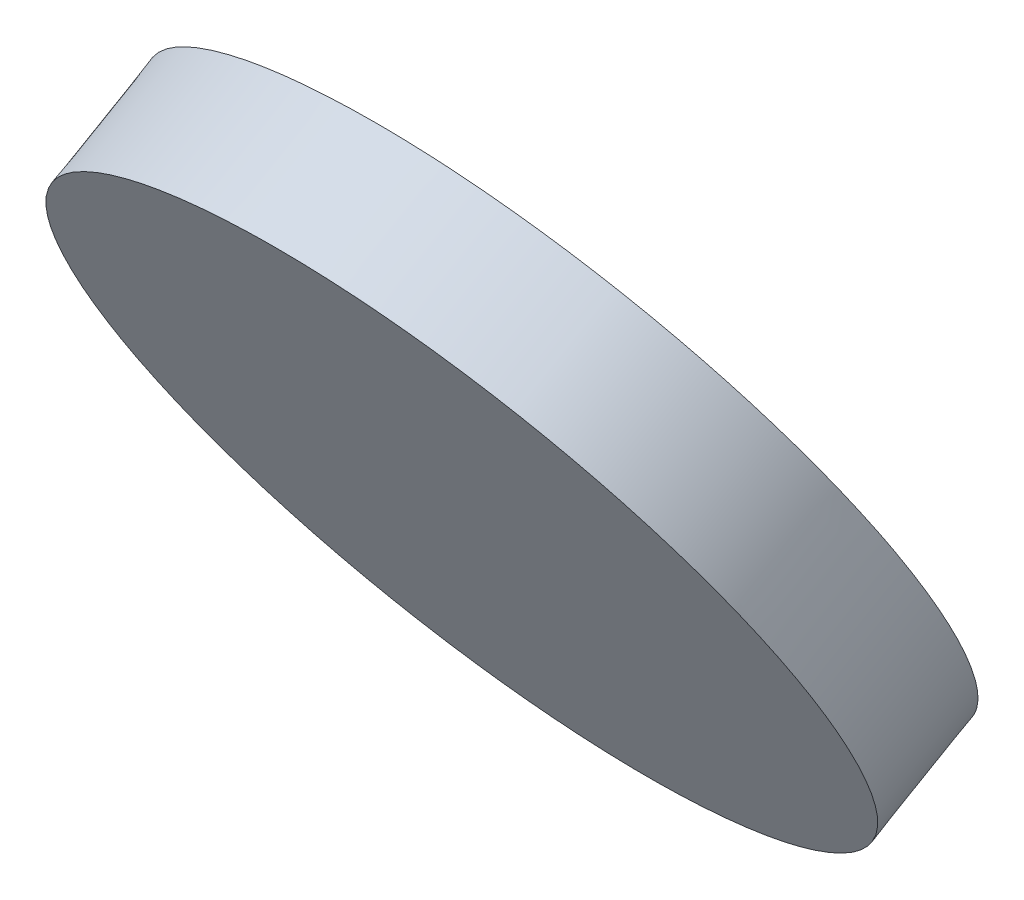
ISO-10303-21;
HEADER;
FILE_DESCRIPTION(('STEP AP214'),'2;1');
FILE_NAME('part.step','',(''),(''),'','','');
FILE_SCHEMA(('AUTOMOTIVE_DESIGN { 1 0 10303 214 1 1 1 1 }'));
ENDSEC;
DATA;
#1=APPLICATION_CONTEXT('core data for automotive mechanical design processes');
#2=APPLICATION_PROTOCOL_DEFINITION('international standard','automotive_design',2000,#1);
#3=PRODUCT_CONTEXT('',#1,'mechanical');
#4=PRODUCT('Part','Part','',(#3));
#5=PRODUCT_RELATED_PRODUCT_CATEGORY('part','',(#4));
#6=PRODUCT_DEFINITION_FORMATION('','',#4);
#7=PRODUCT_DEFINITION_CONTEXT('part definition',#1,'design');
#8=PRODUCT_DEFINITION('design','',#6,#7);
#9=PRODUCT_DEFINITION_SHAPE('','',#8);
#10=(LENGTH_UNIT() NAMED_UNIT(*) SI_UNIT(.MILLI.,.METRE.));
#11=(NAMED_UNIT(*) PLANE_ANGLE_UNIT() SI_UNIT($,.RADIAN.));
#12=(NAMED_UNIT(*) SI_UNIT($,.STERADIAN.) SOLID_ANGLE_UNIT());
#13=UNCERTAINTY_MEASURE_WITH_UNIT(LENGTH_MEASURE(1.E-05),#10,'distance_accuracy_value','');
#14=(GEOMETRIC_REPRESENTATION_CONTEXT(3) GLOBAL_UNCERTAINTY_ASSIGNED_CONTEXT((#13)) GLOBAL_UNIT_ASSIGNED_CONTEXT((#10,
#11,#12)) REPRESENTATION_CONTEXT('',''));
#15=CARTESIAN_POINT('',(0.,0.,0.));
#16=DIRECTION('',(0.,0.,1.));
#17=DIRECTION('',(1.,0.,0.));
#18=AXIS2_PLACEMENT_3D('',#15,#16,#17);
#19=CARTESIAN_POINT('',(12.5,13.3879679238206,-41.0328048076007));
#20=CARTESIAN_POINT('',(12.6682299792076,13.3879679238206,-41.0328048076007));
#21=CARTESIAN_POINT('',(13.0046899376229,13.3300082670677,-41.0662678310291));
#22=CARTESIAN_POINT('',(13.4325454072684,13.0824255601822,-41.2092097734961));
#23=CARTESIAN_POINT('',(13.7184292922025,12.7118918543211,-41.4231375083189));
#24=CARTESIAN_POINT('',(13.8188183624877,12.2748175473052,-41.6754824771304));
#25=CARTESIAN_POINT('',(13.7184292922025,11.8377432402894,-41.9278274459418));
#26=CARTESIAN_POINT('',(13.4325454072684,11.4672095344283,-42.1417551807646));
#27=CARTESIAN_POINT('',(13.0046899376229,11.2196268275428,-42.2846971232316));
#28=CARTESIAN_POINT('',(12.5,11.1326873424135,-42.3348916583742));
#29=CARTESIAN_POINT('',(11.9953100623771,11.2196268275428,-42.2846971232316));
#30=CARTESIAN_POINT('',(11.5674545927316,11.4672095344283,-42.1417551807645));
#31=CARTESIAN_POINT('',(11.2815707077975,11.8377432402894,-41.9278274459418));
#32=CARTESIAN_POINT('',(11.1811816375123,12.2748175473052,-41.6754824771304));
#33=CARTESIAN_POINT('',(11.2815707077975,12.7118918543211,-41.4231375083189));
#34=CARTESIAN_POINT('',(11.5674545927316,13.0824255601822,-41.2092097734961));
#35=CARTESIAN_POINT('',(11.9953100623771,13.3300082670677,-41.0662678310291));
#36=CARTESIAN_POINT('',(12.3317700207924,13.3879679238206,-41.0328048076007));
#37=CARTESIAN_POINT('',(12.5,13.3879679238206,-41.0328048076007));
#38=B_SPLINE_CURVE_WITH_KNOTS('',3,(#19,#20,#21,#22,#23,#24,#25,#26,#27,#28,#29,#30,#31,#32,#33,
#34,#35,#36,#37),.UNSPECIFIED.,.T.,.F.,(4,1,1,1,1,1,1,1,1,1,1,1,1,1,1,1,4),(0.,0.0625,
0.125000000000001,0.1875,0.25,0.3125,0.375,0.4375,0.5,0.5625,0.625,0.6875,0.75,0.8125,
0.874999999999999,0.9375,1.),.UNSPECIFIED.);
#39=DIRECTION('',(0.,0.499999999999995,-0.866025403784442));
#40=VECTOR('',#39,1.);
#41=SURFACE_OF_LINEAR_EXTRUSION('',#38,#40);
#42=CARTESIAN_POINT('',(12.5,13.3879679238206,-41.0328048076007));
#43=CARTESIAN_POINT('',(12.6682299792076,13.3879679238206,-41.0328048076007));
#44=CARTESIAN_POINT('',(13.0046899376229,13.3300082670677,-41.0662678310291));
#45=CARTESIAN_POINT('',(13.4325454072684,13.0824255601822,-41.2092097734961));
#46=CARTESIAN_POINT('',(13.7184292922025,12.7118918543211,-41.4231375083189));
#47=CARTESIAN_POINT('',(13.8188183624877,12.2748175473052,-41.6754824771303));
#48=CARTESIAN_POINT('',(13.7184292922025,11.8377432402894,-41.9278274459418));
#49=CARTESIAN_POINT('',(13.4325454072684,11.4672095344283,-42.1417551807646));
#50=CARTESIAN_POINT('',(13.0046899376229,11.2196268275428,-42.2846971232316));
#51=CARTESIAN_POINT('',(12.5,11.1326873424135,-42.3348916583742));
#52=CARTESIAN_POINT('',(11.9953100623771,11.2196268275428,-42.2846971232316));
#53=CARTESIAN_POINT('',(11.5674545927316,11.4672095344283,-42.1417551807645));
#54=CARTESIAN_POINT('',(11.2815707077975,11.8377432402894,-41.9278274459418));
#55=CARTESIAN_POINT('',(11.1811816375123,12.2748175473052,-41.6754824771304));
#56=CARTESIAN_POINT('',(11.2815707077975,12.7118918543211,-41.4231375083189));
#57=CARTESIAN_POINT('',(11.5674545927316,13.0824255601822,-41.2092097734961));
#58=CARTESIAN_POINT('',(11.9953100623771,13.3300082670677,-41.0662678310291));
#59=CARTESIAN_POINT('',(12.3317700207924,13.3879679238206,-41.0328048076007));
#60=CARTESIAN_POINT('',(12.5,13.3879679238206,-41.0328048076007));
#61=B_SPLINE_CURVE_WITH_KNOTS('',3,(#42,#43,#44,#45,#46,#47,#48,#49,#50,#51,#52,#53,#54,#55,#56,
#57,#58,#59,#60),.UNSPECIFIED.,.T.,.F.,(4,1,1,1,1,1,1,1,1,1,1,1,1,1,1,1,4),(0.,0.0625,
0.125000000000001,0.1875,0.25,0.3125,0.375,0.4375,0.5,0.5625,0.625,0.6875,0.75,0.8125,
0.874999999999999,0.9375,1.),.UNSPECIFIED.);
#62=CARTESIAN_POINT('',(12.5,13.3879679238206,-41.0328048076007));
#63=VERTEX_POINT('',#62);
#64=EDGE_CURVE('E10',#63,#63,#61,.T.);
#65=ORIENTED_EDGE('',*,*,#64,.T.);
#66=EDGE_LOOP('',(#65));
#67=FACE_BOUND('',#66,.T.);
#68=CARTESIAN_POINT('',(12.5,13.5879679238206,-41.3792149691145));
#69=CARTESIAN_POINT('',(12.4789707564107,13.5879679370051,-41.3792149615024));
#70=CARTESIAN_POINT('',(12.4579419493091,13.5875150942108,-41.3794764104116));
#71=CARTESIAN_POINT('',(12.4159343530486,13.5857124585183,-41.3805171626139));
#72=CARTESIAN_POINT('',(12.394955566905,13.5843626128517,-41.3812964963729));
#73=CARTESIAN_POINT('',(12.3530982075204,13.5807746122206,-41.3833680295031));
#74=CARTESIAN_POINT('',(12.3322196412557,13.578536396298,-41.3846602640685));
#75=CARTESIAN_POINT('',(12.2906126141021,13.5731802652805,-41.3877526277533));
#76=CARTESIAN_POINT('',(12.2698841597266,13.5700623122453,-41.3895527787775));
#77=CARTESIAN_POINT('',(12.2286273388163,13.5629552823521,-41.3936560243994));
#78=CARTESIAN_POINT('',(12.2080989722815,13.5589662054942,-41.3959591189972));
#79=CARTESIAN_POINT('',(12.167292290748,13.5501254880213,-41.40106330961));
#80=CARTESIAN_POINT('',(12.1470139650022,13.5452738846176,-41.4038643841411));
#81=CARTESIAN_POINT('',(12.1067573569788,13.5347166816437,-41.40995958812));
#82=CARTESIAN_POINT('',(12.0867790542061,13.529011140702,-41.4132536837186));
#83=CARTESIAN_POINT('',(12.0471724169556,13.5167546200185,-41.4203299892345));
#84=CARTESIAN_POINT('',(12.0275440619585,13.5102036900331,-41.424112170425));
#85=CARTESIAN_POINT('',(11.9886875521215,13.4962651035168,-41.4321596171023));
#86=CARTESIAN_POINT('',(11.9694593972816,13.4888774469859,-41.4364248825891));
#87=CARTESIAN_POINT('',(11.93144586824,13.4732901029195,-41.4454242398818));
#88=CARTESIAN_POINT('',(11.9126605201549,13.4650903676354,-41.4501583592553));
#89=CARTESIAN_POINT('',(11.8755748796246,13.4479034004617,-41.4600812593796));
#90=CARTESIAN_POINT('',(11.8572746205572,13.4389161145649,-41.4652700713115));
#91=CARTESIAN_POINT('',(11.8212015232752,13.4201785584249,-41.4760882043928));
#92=CARTESIAN_POINT('',(11.8034287078442,13.4104282552884,-41.4817175445333));
#93=CARTESIAN_POINT('',(11.7684528661265,13.3901891460976,-41.4934025996728));
#94=CARTESIAN_POINT('',(11.7512498398399,13.3797003400433,-41.4994583146718));
#95=CARTESIAN_POINT('',(11.7174559596882,13.3580086937487,-41.5119819924991));
#96=CARTESIAN_POINT('',(11.7008650794512,13.3468058843254,-41.5184499375353));
#97=CARTESIAN_POINT('',(11.668337890586,13.3237107142865,-41.5317839401743));
#98=CARTESIAN_POINT('',(11.6524015371157,13.3118184010442,-41.538649970426));
#99=CARTESIAN_POINT('',(11.6212257453276,13.287368675224,-41.5527660262099));
#100=CARTESIAN_POINT('',(11.6059862660659,13.2748113018148,-41.560016029128));
#101=CARTESIAN_POINT('',(11.5762467809678,13.2490561522244,-41.574885771677));
#102=CARTESIAN_POINT('',(11.5617467751315,13.2358583760433,-41.5825055113079));
#103=CARTESIAN_POINT('',(11.5335146635638,13.2088593483717,-41.598093407202));
#104=CARTESIAN_POINT('',(11.5197826030603,13.1950580614227,-41.6060615839371));
#105=CARTESIAN_POINT('',(11.4931145977823,13.1668886895517,-41.6223251783697));
#106=CARTESIAN_POINT('',(11.4801787077099,13.1525205657954,-41.6306206184882));
#107=CARTESIAN_POINT('',(11.4551313520553,13.1232542070916,-41.6475175585641));
#108=CARTESIAN_POINT('',(11.4430199220574,13.1083559493053,-41.6561190717074));
#109=CARTESIAN_POINT('',(11.4196498117784,13.0780659818592,-41.6736069925662));
#110=CARTESIAN_POINT('',(11.4083911314974,13.0626742721992,-41.6824934002817));
#111=CARTESIAN_POINT('',(11.3867548653347,13.0314340535596,-41.7005299489228));
#112=CARTESIAN_POINT('',(11.376377241471,13.015585564311,-41.7096800784567));
#113=CARTESIAN_POINT('',(11.3565314412224,12.983468457497,-41.7282228987214));
#114=CARTESIAN_POINT('',(11.3470632024752,12.9671998688375,-41.7376155727632));
#115=CARTESIAN_POINT('',(11.32906448789,12.9342791869969,-41.7566223372858));
#116=CARTESIAN_POINT('',(11.3205339569167,12.9176271164334,-41.7662364147082));
#117=CARTESIAN_POINT('',(11.3044390635613,12.8839763918238,-41.78566466962));
#118=CARTESIAN_POINT('',(11.2968747011792,12.8669777377776,-41.7954788471094));
#119=CARTESIAN_POINT('',(11.2827220901504,12.8326773837169,-41.8152821657597));
#120=CARTESIAN_POINT('',(11.2761338989574,12.8153756659322,-41.8252713171802));
#121=CARTESIAN_POINT('',(11.2639434909883,12.7805124208753,-41.8453996210986));
#122=CARTESIAN_POINT('',(11.2583413419106,12.7629508758539,-41.855538783844));
#123=CARTESIAN_POINT('',(11.2481329607271,12.7276112523987,-41.875942124959));
#124=CARTESIAN_POINT('',(11.2435267715891,12.7098331646577,-41.8862063087019));
#125=CARTESIAN_POINT('',(11.2353202801882,12.6741037119205,-41.9068347178577));
#126=CARTESIAN_POINT('',(11.2317199779253,12.6561523469245,-41.9171989432705));
#127=CARTESIAN_POINT('',(11.2255352511417,12.6201195960344,-41.9380024616965));
#128=CARTESIAN_POINT('',(11.2229507828111,12.6020382157818,-41.9484417514527));
#129=CARTESIAN_POINT('',(11.2188077143643,12.5657887105628,-41.9693704130489));
#130=CARTESIAN_POINT('',(11.2172490438598,12.5476205916345,-41.9798597814028));
#131=CARTESIAN_POINT('',(11.2151675476143,12.5112408291569,-42.0008636470623));
#132=CARTESIAN_POINT('',(11.2146446609407,12.4930291882311,-42.0113781428532));
#133=CARTESIAN_POINT('',(11.2146446609407,12.4566059063794,-42.032407134435));
#134=CARTESIAN_POINT('',(11.2151675476143,12.4383942654536,-42.042921630226));
#135=CARTESIAN_POINT('',(11.2172490438598,12.402014502976,-42.0639254958854));
#136=CARTESIAN_POINT('',(11.2188077143643,12.3838463840476,-42.0744148642394));
#137=CARTESIAN_POINT('',(11.2229507828111,12.3475968788287,-42.0953435258355));
#138=CARTESIAN_POINT('',(11.2255352511417,12.3295154985761,-42.1057828155917));
#139=CARTESIAN_POINT('',(11.2317199779253,12.293482747686,-42.1265863340177));
#140=CARTESIAN_POINT('',(11.2353202801882,12.2755313826899,-42.1369505594305));
#141=CARTESIAN_POINT('',(11.2435267715891,12.2398019299528,-42.1575789685863));
#142=CARTESIAN_POINT('',(11.2481329607271,12.2220238422118,-42.1678431523293));
#143=CARTESIAN_POINT('',(11.2583413419106,12.1866842187565,-42.1882464934442));
#144=CARTESIAN_POINT('',(11.2639434909883,12.1691226737352,-42.1983856561897));
#145=CARTESIAN_POINT('',(11.2761338989574,12.1342594286783,-42.2185139601081));
#146=CARTESIAN_POINT('',(11.2827220901504,12.1169577108936,-42.2285031115286));
#147=CARTESIAN_POINT('',(11.2968747011792,12.0826573568328,-42.2483064301788));
#148=CARTESIAN_POINT('',(11.3044390635613,12.0656587027867,-42.2581206076682));
#149=CARTESIAN_POINT('',(11.3205339569167,12.032007978177,-42.27754886258));
#150=CARTESIAN_POINT('',(11.32906448789,12.0153559076135,-42.2871629400024));
#151=CARTESIAN_POINT('',(11.3470632024752,11.9824352257729,-42.306169704525));
#152=CARTESIAN_POINT('',(11.3565314412224,11.9661666371135,-42.3155623785669));
#153=CARTESIAN_POINT('',(11.376377241471,11.9340495302994,-42.3341051988316));
#154=CARTESIAN_POINT('',(11.3867548653347,11.9182010410509,-42.3432553283655));
#155=CARTESIAN_POINT('',(11.4083911314974,11.8869608224113,-42.3612918770066));
#156=CARTESIAN_POINT('',(11.4196498117784,11.8715691127513,-42.370178284722));
#157=CARTESIAN_POINT('',(11.4430199220574,11.8412791453051,-42.3876662055808));
#158=CARTESIAN_POINT('',(11.4551313520553,11.8263808875189,-42.3962677187242));
#159=CARTESIAN_POINT('',(11.4801787077099,11.7971145288151,-42.4131646588));
#160=CARTESIAN_POINT('',(11.4931145977823,11.7827464050587,-42.4214600989185));
#161=CARTESIAN_POINT('',(11.5197826030603,11.7545770331877,-42.4377236933511));
#162=CARTESIAN_POINT('',(11.5335146635638,11.7407757462388,-42.4456918700863));
#163=CARTESIAN_POINT('',(11.5617467751315,11.7137767185672,-42.4612797659803));
#164=CARTESIAN_POINT('',(11.5762467809678,11.7005789423861,-42.4688995056112));
#165=CARTESIAN_POINT('',(11.6059862660659,11.6748237927957,-42.4837692481602));
#166=CARTESIAN_POINT('',(11.6212257453276,11.6622664193864,-42.4910192510784));
#167=CARTESIAN_POINT('',(11.6524015371157,11.6378166935663,-42.5051353068622));
#168=CARTESIAN_POINT('',(11.668337890586,11.625924380324,-42.512001337114));
#169=CARTESIAN_POINT('',(11.7008650794512,11.602829210285,-42.5253353397529));
#170=CARTESIAN_POINT('',(11.7174559596882,11.5916264008617,-42.5318032847892));
#171=CARTESIAN_POINT('',(11.7512498398399,11.5699347545672,-42.5443269626165));
#172=CARTESIAN_POINT('',(11.7684528661265,11.5594459485129,-42.5503826776154));
#173=CARTESIAN_POINT('',(11.8034287078442,11.539206839322,-42.5620677327549));
#174=CARTESIAN_POINT('',(11.8212015232751,11.5294565361856,-42.5676970728954));
#175=CARTESIAN_POINT('',(11.8572746205573,11.5107189800456,-42.5785152059768));
#176=CARTESIAN_POINT('',(11.8755748796251,11.5017316941488,-42.5837040179086));
#177=CARTESIAN_POINT('',(11.9126605201545,11.484544726975,-42.5936269180329));
#178=CARTESIAN_POINT('',(11.9314458682382,11.4763449916909,-42.5983610374065));
#179=CARTESIAN_POINT('',(11.9694593972834,11.4607576476247,-42.6073603946991));
#180=CARTESIAN_POINT('',(11.9886875521282,11.453369991094,-42.6116256601858));
#181=CARTESIAN_POINT('',(12.0275440619518,11.439431404577,-42.6196731068635));
#182=CARTESIAN_POINT('',(12.0471724169306,11.4328804745907,-42.6234552880545));
#183=CARTESIAN_POINT('',(12.0867790542311,11.4206239539098,-42.6305315935689));
#184=CARTESIAN_POINT('',(12.1067573570721,11.4149184129717,-42.6338256891654));
#185=CARTESIAN_POINT('',(12.1470139649089,11.404361209988,-42.63992089315));
#186=CARTESIAN_POINT('',(12.1672922903998,11.3995096065709,-42.6427219676888));
#187=CARTESIAN_POINT('',(12.2080989726297,11.3906688891345,-42.6478261582806));
#188=CARTESIAN_POINT('',(12.2286273401156,11.3866798123263,-42.6501292528496));
#189=CARTESIAN_POINT('',(12.2698841584272,11.3795727822972,-42.65423249855));
#190=CARTESIAN_POINT('',(12.2906126092528,11.3764548290763,-42.6560326496814));
#191=CARTESIAN_POINT('',(12.3322196461048,11.3710986985662,-42.6591250130733));
#192=CARTESIAN_POINT('',(12.3530982256172,11.3688604833367,-42.6604172472385));
#193=CARTESIAN_POINT('',(12.3949555488095,11.3652724808121,-42.6624887814619));
#194=CARTESIAN_POINT('',(12.4159342855174,11.3639226325591,-42.6632681167142));
#195=CARTESIAN_POINT('',(12.4579420168363,11.3621200039326,-42.6643088648369));
#196=CARTESIAN_POINT('',(12.4789710084182,11.3616671707899,-42.6645703081738));
#197=CARTESIAN_POINT('',(12.5210289915818,11.3616671707899,-42.6645703081738));
#198=CARTESIAN_POINT('',(12.5420579831637,11.3621200039326,-42.6643088648369));
#199=CARTESIAN_POINT('',(12.5840657144826,11.3639226325591,-42.6632681167142));
#200=CARTESIAN_POINT('',(12.6050444511905,11.3652724808121,-42.6624887814619));
#201=CARTESIAN_POINT('',(12.6469017743828,11.3688604833367,-42.6604172472385));
#202=CARTESIAN_POINT('',(12.6677803538952,11.3710986985662,-42.6591250130733));
#203=CARTESIAN_POINT('',(12.7093873907472,11.3764548290763,-42.6560326496814));
#204=CARTESIAN_POINT('',(12.7301158415728,11.3795727822972,-42.65423249855));
#205=CARTESIAN_POINT('',(12.7713726598844,11.3866798123263,-42.6501292528496));
#206=CARTESIAN_POINT('',(12.7919010273703,11.3906688891345,-42.6478261582805));
#207=CARTESIAN_POINT('',(12.8327077096002,11.3995096065709,-42.6427219676888));
#208=CARTESIAN_POINT('',(12.8529860350911,11.404361209988,-42.63992089315));
#209=CARTESIAN_POINT('',(12.8932426429279,11.4149184129717,-42.6338256891654));
#210=CARTESIAN_POINT('',(12.9132209457689,11.4206239539098,-42.6305315935689));
#211=CARTESIAN_POINT('',(12.9528275830694,11.4328804745907,-42.6234552880545));
#212=CARTESIAN_POINT('',(12.9724559380482,11.439431404577,-42.6196731068635));
#213=CARTESIAN_POINT('',(13.0113124478718,11.453369991094,-42.6116256601858));
#214=CARTESIAN_POINT('',(13.0305406027166,11.4607576476247,-42.6073603946991));
#215=CARTESIAN_POINT('',(13.0685541317618,11.4763449916909,-42.5983610374065));
#216=CARTESIAN_POINT('',(13.0873394798455,11.484544726975,-42.5936269180329));
#217=CARTESIAN_POINT('',(13.1244251203749,11.5017316941488,-42.5837040179086));
#218=CARTESIAN_POINT('',(13.1427253794427,11.5107189800456,-42.5785152059768));
#219=CARTESIAN_POINT('',(13.1787984767249,11.5294565361856,-42.5676970728954));
#220=CARTESIAN_POINT('',(13.1965712921558,11.539206839322,-42.5620677327549));
#221=CARTESIAN_POINT('',(13.2315471338735,11.5594459485129,-42.5503826776154));
#222=CARTESIAN_POINT('',(13.2487501601601,11.5699347545672,-42.5443269626165));
#223=CARTESIAN_POINT('',(13.2825440403118,11.5916264008617,-42.5318032847892));
#224=CARTESIAN_POINT('',(13.2991349205488,11.602829210285,-42.5253353397529));
#225=CARTESIAN_POINT('',(13.331662109414,11.625924380324,-42.512001337114));
#226=CARTESIAN_POINT('',(13.3475984628843,11.6378166935663,-42.5051353068622));
#227=CARTESIAN_POINT('',(13.3787742546724,11.6622664193864,-42.4910192510784));
#228=CARTESIAN_POINT('',(13.3940137339341,11.6748237927957,-42.4837692481602));
#229=CARTESIAN_POINT('',(13.4237532190322,11.7005789423861,-42.4688995056112));
#230=CARTESIAN_POINT('',(13.4382532248685,11.7137767185672,-42.4612797659803));
#231=CARTESIAN_POINT('',(13.4664853364362,11.7407757462388,-42.4456918700863));
#232=CARTESIAN_POINT('',(13.4802173969397,11.7545770331877,-42.4377236933511));
#233=CARTESIAN_POINT('',(13.5068854022177,11.7827464050587,-42.4214600989185));
#234=CARTESIAN_POINT('',(13.5198212922901,11.7971145288151,-42.4131646588));
#235=CARTESIAN_POINT('',(13.5448686479447,11.8263808875189,-42.3962677187242));
#236=CARTESIAN_POINT('',(13.5569800779426,11.8412791453051,-42.3876662055808));
#237=CARTESIAN_POINT('',(13.5803501882216,11.8715691127513,-42.370178284722));
#238=CARTESIAN_POINT('',(13.5916088685026,11.8869608224113,-42.3612918770066));
#239=CARTESIAN_POINT('',(13.6132451346653,11.9182010410509,-42.3432553283655));
#240=CARTESIAN_POINT('',(13.623622758529,11.9340495302994,-42.3341051988316));
#241=CARTESIAN_POINT('',(13.6434685587776,11.9661666371135,-42.3155623785669));
#242=CARTESIAN_POINT('',(13.6529367975247,11.9824352257729,-42.306169704525));
#243=CARTESIAN_POINT('',(13.67093551211,12.0153559076135,-42.2871629400024));
#244=CARTESIAN_POINT('',(13.6794660430833,12.032007978177,-42.27754886258));
#245=CARTESIAN_POINT('',(13.6955609364387,12.0656587027867,-42.2581206076682));
#246=CARTESIAN_POINT('',(13.7031252988208,12.0826573568328,-42.2483064301788));
#247=CARTESIAN_POINT('',(13.7172779098496,12.1169577108936,-42.2285031115286));
#248=CARTESIAN_POINT('',(13.7238661010426,12.1342594286783,-42.2185139601081));
#249=CARTESIAN_POINT('',(13.7360565090117,12.1691226737352,-42.1983856561897));
#250=CARTESIAN_POINT('',(13.7416586580894,12.1866842187565,-42.1882464934442));
#251=CARTESIAN_POINT('',(13.7518670392729,12.2220238422118,-42.1678431523293));
#252=CARTESIAN_POINT('',(13.7564732284109,12.2398019299528,-42.1575789685863));
#253=CARTESIAN_POINT('',(13.7646797198118,12.2755313826899,-42.1369505594305));
#254=CARTESIAN_POINT('',(13.7682800220747,12.293482747686,-42.1265863340177));
#255=CARTESIAN_POINT('',(13.7744647488583,12.3295154985761,-42.1057828155917));
#256=CARTESIAN_POINT('',(13.7770492171889,12.3475968788287,-42.0953435258355));
#257=CARTESIAN_POINT('',(13.7811922856357,12.3838463840476,-42.0744148642394));
#258=CARTESIAN_POINT('',(13.7827509561402,12.402014502976,-42.0639254958854));
#259=CARTESIAN_POINT('',(13.7848324523857,12.4383942654536,-42.0429216302259));
#260=CARTESIAN_POINT('',(13.7853553390593,12.4566059063794,-42.032407134435));
#261=CARTESIAN_POINT('',(13.7853553390593,12.4930291882311,-42.0113781428532));
#262=CARTESIAN_POINT('',(13.7848324523857,12.5112408291569,-42.0008636470623));
#263=CARTESIAN_POINT('',(13.7827509561402,12.5476205916345,-41.9798597814028));
#264=CARTESIAN_POINT('',(13.7811922856357,12.5657887105628,-41.9693704130488));
#265=CARTESIAN_POINT('',(13.7770492171889,12.6020382157818,-41.9484417514527));
#266=CARTESIAN_POINT('',(13.7744647488583,12.6201195960344,-41.9380024616965));
#267=CARTESIAN_POINT('',(13.7682800220747,12.6561523469245,-41.9171989432705));
#268=CARTESIAN_POINT('',(13.7646797198118,12.6741037119205,-41.9068347178577));
#269=CARTESIAN_POINT('',(13.7564732284109,12.7098331646577,-41.8862063087019));
#270=CARTESIAN_POINT('',(13.7518670392729,12.7276112523987,-41.875942124959));
#271=CARTESIAN_POINT('',(13.7416586580894,12.7629508758539,-41.855538783844));
#272=CARTESIAN_POINT('',(13.7360565090117,12.7805124208753,-41.8453996210986));
#273=CARTESIAN_POINT('',(13.7238661010426,12.8153756659321,-41.8252713171802));
#274=CARTESIAN_POINT('',(13.7172779098496,12.8326773837169,-41.8152821657597));
#275=CARTESIAN_POINT('',(13.7031252988208,12.8669777377776,-41.7954788471094));
#276=CARTESIAN_POINT('',(13.6955609364387,12.8839763918238,-41.78566466962));
#277=CARTESIAN_POINT('',(13.6794660430833,12.9176271164334,-41.7662364147082));
#278=CARTESIAN_POINT('',(13.67093551211,12.9342791869969,-41.7566223372858));
#279=CARTESIAN_POINT('',(13.6529367975248,12.9671998688375,-41.7376155727632));
#280=CARTESIAN_POINT('',(13.6434685587776,12.983468457497,-41.7282228987214));
#281=CARTESIAN_POINT('',(13.623622758529,13.015585564311,-41.7096800784567));
#282=CARTESIAN_POINT('',(13.6132451346653,13.0314340535596,-41.7005299489228));
#283=CARTESIAN_POINT('',(13.5916088685026,13.0626742721992,-41.6824934002817));
#284=CARTESIAN_POINT('',(13.5803501882216,13.0780659818591,-41.6736069925662));
#285=CARTESIAN_POINT('',(13.5569800779426,13.1083559493053,-41.6561190717074));
#286=CARTESIAN_POINT('',(13.5448686479447,13.1232542070916,-41.6475175585641));
#287=CARTESIAN_POINT('',(13.5198212922901,13.1525205657954,-41.6306206184882));
#288=CARTESIAN_POINT('',(13.5068854022176,13.1668886895517,-41.6223251783697));
#289=CARTESIAN_POINT('',(13.4802173969397,13.1950580614227,-41.6060615839371));
#290=CARTESIAN_POINT('',(13.4664853364362,13.2088593483717,-41.598093407202));
#291=CARTESIAN_POINT('',(13.4382532248685,13.2358583760433,-41.5825055113079));
#292=CARTESIAN_POINT('',(13.4237532190322,13.2490561522244,-41.5748857716771));
#293=CARTESIAN_POINT('',(13.3940137339341,13.2748113018148,-41.560016029128));
#294=CARTESIAN_POINT('',(13.3787742546724,13.287368675224,-41.5527660262099));
#295=CARTESIAN_POINT('',(13.3475984628843,13.3118184010441,-41.538649970426));
#296=CARTESIAN_POINT('',(13.331662109414,13.3237107142865,-41.5317839401743));
#297=CARTESIAN_POINT('',(13.2991349205488,13.3468058843254,-41.5184499375353));
#298=CARTESIAN_POINT('',(13.2825440403118,13.3580086937487,-41.5119819924991));
#299=CARTESIAN_POINT('',(13.2487501601601,13.3797003400433,-41.4994583146718));
#300=CARTESIAN_POINT('',(13.2315471338735,13.3901891460976,-41.4934025996728));
#301=CARTESIAN_POINT('',(13.1965712921558,13.4104282552884,-41.4817175445333));
#302=CARTESIAN_POINT('',(13.1787984767248,13.4201785584249,-41.4760882043928));
#303=CARTESIAN_POINT('',(13.1427253794428,13.4389161145649,-41.4652700713115));
#304=CARTESIAN_POINT('',(13.1244251203754,13.4479034004617,-41.4600812593796));
#305=CARTESIAN_POINT('',(13.0873394798451,13.4650903676354,-41.4501583592553));
#306=CARTESIAN_POINT('',(13.06855413176,13.4732901029195,-41.4454242398818));
#307=CARTESIAN_POINT('',(13.0305406027184,13.4888774469859,-41.4364248825891));
#308=CARTESIAN_POINT('',(13.0113124478785,13.4962651035168,-41.4321596171023));
#309=CARTESIAN_POINT('',(12.9724559380415,13.5102036900331,-41.424112170425));
#310=CARTESIAN_POINT('',(12.9528275830444,13.5167546200185,-41.4203299892345));
#311=CARTESIAN_POINT('',(12.9132209457939,13.529011140702,-41.4132536837186));
#312=CARTESIAN_POINT('',(12.8932426430212,13.5347166816437,-41.40995958812));
#313=CARTESIAN_POINT('',(12.8529860349978,13.5452738846176,-41.4038643841411));
#314=CARTESIAN_POINT('',(12.832707709252,13.5501254880213,-41.4010633096099));
#315=CARTESIAN_POINT('',(12.7919010277185,13.5589662054942,-41.3959591189972));
#316=CARTESIAN_POINT('',(12.7713726611837,13.5629552823521,-41.3936560243994));
#317=CARTESIAN_POINT('',(12.7301158402734,13.5700623122453,-41.3895527787775));
#318=CARTESIAN_POINT('',(12.7093873858979,13.5731802652805,-41.3877526277533));
#319=CARTESIAN_POINT('',(12.6677803587443,13.578536396298,-41.3846602640685));
#320=CARTESIAN_POINT('',(12.6469017924796,13.5807746122206,-41.3833680295031));
#321=CARTESIAN_POINT('',(12.605044433095,13.5843626128516,-41.3812964963729));
#322=CARTESIAN_POINT('',(12.5840656469514,13.5857124585183,-41.3805171626139));
#323=CARTESIAN_POINT('',(12.5420580506909,13.5875150942108,-41.3794764104116));
#324=CARTESIAN_POINT('',(12.5210292435893,13.5879679370051,-41.3792149615024));
#325=CARTESIAN_POINT('',(12.5,13.5879679238206,-41.3792149691145));
#326=B_SPLINE_CURVE_WITH_KNOTS('',3,(#68,#69,#70,#71,#72,#73,#74,#75,#76,#77,#78,#79,#80,#81,
#82,#83,#84,#85,#86,#87,#88,#89,#90,#91,#92,#93,#94,#95,#96,#97,#98,#99,#100,#101,#102,#103,
#104,#105,#106,#107,#108,#109,#110,#111,#112,#113,#114,#115,#116,#117,#118,#119,#120,#121,#122,
#123,#124,#125,#126,#127,#128,#129,#130,#131,#132,#133,#134,#135,#136,#137,#138,#139,#140,#141,
#142,#143,#144,#145,#146,#147,#148,#149,#150,#151,#152,#153,#154,#155,#156,#157,#158,#159,#160,
#161,#162,#163,#164,#165,#166,#167,#168,#169,#170,#171,#172,#173,#174,#175,#176,#177,#178,#179,
#180,#181,#182,#183,#184,#185,#186,#187,#188,#189,#190,#191,#192,#193,#194,#195,#196,#197,#198,
#199,#200,#201,#202,#203,#204,#205,#206,#207,#208,#209,#210,#211,#212,#213,#214,#215,#216,#217,
#218,#219,#220,#221,#222,#223,#224,#225,#226,#227,#228,#229,#230,#231,#232,#233,#234,#235,#236,
#237,#238,#239,#240,#241,#242,#243,#244,#245,#246,#247,#248,#249,#250,#251,#252,#253,#254,#255,
#256,#257,#258,#259,#260,#261,#262,#263,#264,#265,#266,#267,#268,#269,#270,#271,#272,#273,#274,
#275,#276,#277,#278,#279,#280,#281,#282,#283,#284,#285,#286,#287,#288,#289,#290,#291,#292,#293,
#294,#295,#296,#297,#298,#299,#300,#301,#302,#303,#304,#305,#306,#307,#308,#309,#310,#311,#312,
#313,#314,#315,#316,#317,#318,#319,#320,#321,#322,#323,#324,#325),.UNSPECIFIED.,.F.,.F.,(4,2,2,
2,2,2,2,2,2,2,2,2,2,2,2,2,2,2,2,2,2,2,2,2,2,2,2,2,2,2,2,2,2,2,2,2,2,2,2,2,2,2,2,2,2,2,2,2,2,2,2,
2,2,2,2,2,2,2,2,2,2,2,2,2,2,2,2,2,2,2,2,2,2,2,2,2,2,2,2,2,2,2,2,2,2,2,2,2,2,2,2,2,2,2,2,2,2,2,2,
2,2,2,2,2,2,2,2,2,2,2,2,2,2,2,2,2,2,2,2,2,2,2,2,2,2,2,2,2,4),(0.,0.0630806127990792,
0.12616493680959,0.18925359029085,0.252344965001653,0.315436339712458,0.378524993193719,
0.441609317204227,0.504689930003304,0.567770542802381,0.630854866812893,0.693943520294148,
0.757034895004956,0.820126269715761,0.88321492319702,0.946299247207531,1.00937986000661,
1.07246047280569,1.1355447968162,1.19863345029746,1.26172482500826,1.32481619971907,
1.38790485320033,1.45098917721084,1.51406979000991,1.57715040280899,1.6402347268195,
1.70332338030076,1.76641475501156,1.82950612972238,1.89259478320364,1.95567910721414,
2.01875972001322,2.0818403328123,2.14492465682281,2.20801331030407,2.27110468501487,
2.33419605972568,2.39728471320693,2.46036903721745,2.52344965001653,2.5865302628156,
2.64961458682611,2.71270324030737,2.77579461501817,2.83888598972898,2.90197464321024,
2.96505896722075,3.02813958001983,3.09122019281891,3.15430451682942,3.21739317031068,
3.28048454502148,3.34357591973229,3.40666457321355,3.46974889722406,3.53282951002313,
3.59591012282221,3.65899444683272,3.72208310031398,3.78517447502478,3.84826584973559,
3.91135450321685,3.97443882722736,4.03751944002644,4.10060005282552,4.16368437683603,
4.22677303031729,4.28986440502809,4.3529557797389,4.41604443322016,4.47912875723067,
4.54220937002975,4.60528998282882,4.66837430683933,4.73146296032059,4.7945543350314,
4.8576457097422,4.92073436322346,4.98381868723397,5.04689930003305,5.10997991283213,
5.17306423684264,5.2361528903239,5.2992442650347,5.36233563974551,5.42542429322677,
5.48850861723728,5.55158923003635,5.61466984283543,5.67775416684594,5.7408428203272,
5.80393419503801,5.86702556974881,5.93011422323007,5.99319854724058,6.05627916003966,
6.11935977283874,6.18244409684926,6.24553275033051,6.30862412504131,6.37171549975212,
6.43480415323338,6.49788847724389,6.56096909004296,6.62404970284204,6.68713402685255,
6.75022268033381,6.81331405504462,6.87640542975542,6.93949408323668,7.00257840724719,
7.06565902004627,7.12873963284534,7.19182395685585,7.25491261033711,7.31800398504792,
7.38109535975873,7.44418401323998,7.50726833725049,7.57034895004957,7.63342956284864,
7.69651388685916,7.75960254034042,7.82269391505122,7.88578528976203,7.94887394324328,
8.0119582672538,8.07503888005287),.UNSPECIFIED.);
#327=CARTESIAN_POINT('',(12.5,13.5879679238206,-41.3792149691145));
#328=VERTEX_POINT('',#327);
#329=EDGE_CURVE('E25',#328,#328,#326,.F.);
#330=ORIENTED_EDGE('',*,*,#329,.F.);
#331=EDGE_LOOP('',(#330));
#332=FACE_BOUND('',#331,.T.);
#333=ADVANCED_FACE('F15',(#67,#332),#41,.T.);
#334=CARTESIAN_POINT('',(0.,-10.4583493020364,-54.8004824771302));
#335=DIRECTION('',(0.,0.499999999999995,-0.866025403784442));
#336=DIRECTION('',(-1.,0.,0.));
#337=AXIS2_PLACEMENT_3D('',#334,#335,#336);
#338=PLANE('',#337);
#339=ORIENTED_EDGE('',*,*,#64,.F.);
#340=EDGE_LOOP('',(#339));
#341=FACE_BOUND('',#340,.T.);
#342=ADVANCED_FACE('F63',(#341),#338,.F.);
#343=CARTESIAN_POINT('',(0.,-10.2583493020364,-55.146892638644));
#344=DIRECTION('',(0.,0.499999999999995,-0.866025403784442));
#345=DIRECTION('',(-1.,0.,0.));
#346=AXIS2_PLACEMENT_3D('',#343,#344,#345);
#347=PLANE('',#346);
#348=ORIENTED_EDGE('',*,*,#329,.T.);
#349=EDGE_LOOP('',(#348));
#350=FACE_BOUND('',#349,.T.);
#351=ADVANCED_FACE('F32',(#350),#347,.T.);
#352=CLOSED_SHELL('',(#333,#342,#351));
#353=MANIFOLD_SOLID_BREP('B1',#352);
#354=ADVANCED_BREP_SHAPE_REPRESENTATION('',(#18,#353),#14);
#355=SHAPE_DEFINITION_REPRESENTATION(#9,#354);
ENDSEC;
END-ISO-10303-21;
